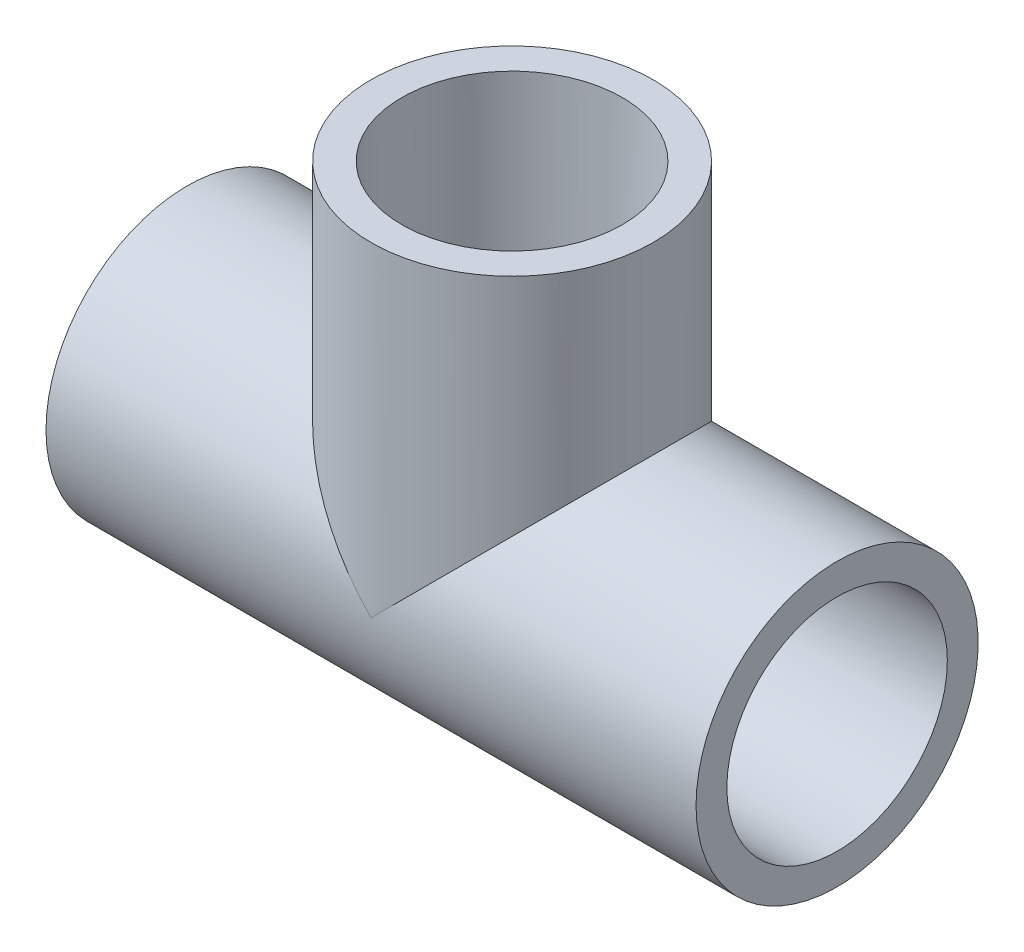
ISO-10303-21;
HEADER;
FILE_DESCRIPTION(('STEP AP214'),'2;1');
FILE_NAME('part.step','',(''),(''),'','','');
FILE_SCHEMA(('AUTOMOTIVE_DESIGN { 1 0 10303 214 1 1 1 1 }'));
ENDSEC;
DATA;
#1=APPLICATION_CONTEXT('core data for automotive mechanical design processes');
#2=APPLICATION_PROTOCOL_DEFINITION('international standard','automotive_design',2000,#1);
#3=PRODUCT_CONTEXT('',#1,'mechanical');
#4=PRODUCT('Part','Part','',(#3));
#5=PRODUCT_RELATED_PRODUCT_CATEGORY('part','',(#4));
#6=PRODUCT_DEFINITION_FORMATION('','',#4);
#7=PRODUCT_DEFINITION_CONTEXT('part definition',#1,'design');
#8=PRODUCT_DEFINITION('design','',#6,#7);
#9=PRODUCT_DEFINITION_SHAPE('','',#8);
#10=(LENGTH_UNIT() NAMED_UNIT(*) SI_UNIT(.MILLI.,.METRE.));
#11=(NAMED_UNIT(*) PLANE_ANGLE_UNIT() SI_UNIT($,.RADIAN.));
#12=(NAMED_UNIT(*) SI_UNIT($,.STERADIAN.) SOLID_ANGLE_UNIT());
#13=UNCERTAINTY_MEASURE_WITH_UNIT(LENGTH_MEASURE(1.E-05),#10,'distance_accuracy_value','');
#14=(GEOMETRIC_REPRESENTATION_CONTEXT(3) GLOBAL_UNCERTAINTY_ASSIGNED_CONTEXT((#13)) GLOBAL_UNIT_ASSIGNED_CONTEXT((#10,
#11,#12)) REPRESENTATION_CONTEXT('',''));
#15=CARTESIAN_POINT('',(0.,0.,0.));
#16=DIRECTION('',(0.,0.,1.));
#17=DIRECTION('',(1.,0.,0.));
#18=AXIS2_PLACEMENT_3D('',#15,#16,#17);
#19=CARTESIAN_POINT('',(-12.7,0.,0.));
#20=DIRECTION('',(1.,0.,0.));
#21=DIRECTION('',(0.,0.,-1.));
#22=AXIS2_PLACEMENT_3D('',#19,#20,#21);
#23=PLANE('',#22);
#24=CARTESIAN_POINT('',(-12.7,0.,0.));
#25=DIRECTION('',(-1.,0.,0.));
#26=DIRECTION('',(0.,0.,1.));
#27=AXIS2_PLACEMENT_3D('',#24,#25,#26);
#28=CIRCLE('',#27,10.6172);
#29=CARTESIAN_POINT('',(-12.7,0.,10.6172));
#30=VERTEX_POINT('',#29);
#31=EDGE_CURVE('E124',#30,#30,#28,.T.);
#32=ORIENTED_EDGE('',*,*,#31,.T.);
#33=EDGE_LOOP('',(#32));
#34=FACE_BOUND('',#33,.T.);
#35=CARTESIAN_POINT('',(-12.7,0.,0.));
#36=DIRECTION('',(1.,0.,0.));
#37=DIRECTION('',(0.,0.,-1.));
#38=AXIS2_PLACEMENT_3D('',#35,#36,#37);
#39=CIRCLE('',#38,7.8994);
#40=CARTESIAN_POINT('',(-12.7,0.,-7.8994));
#41=VERTEX_POINT('',#40);
#42=EDGE_CURVE('E127',#41,#41,#39,.T.);
#43=ORIENTED_EDGE('',*,*,#42,.T.);
#44=EDGE_LOOP('',(#43));
#45=FACE_BOUND('',#44,.T.);
#46=ADVANCED_FACE('F34',(#34,#45),#23,.F.);
#47=CARTESIAN_POINT('',(12.7,0.,0.));
#48=DIRECTION('',(1.,0.,0.));
#49=DIRECTION('',(0.,0.,-1.));
#50=AXIS2_PLACEMENT_3D('',#47,#48,#49);
#51=PLANE('',#50);
#52=CARTESIAN_POINT('',(12.7,0.,0.));
#53=DIRECTION('',(1.,0.,0.));
#54=DIRECTION('',(0.,0.,-1.));
#55=AXIS2_PLACEMENT_3D('',#52,#53,#54);
#56=CIRCLE('',#55,7.8994);
#57=CARTESIAN_POINT('',(12.7,0.,-7.8994));
#58=VERTEX_POINT('',#57);
#59=EDGE_CURVE('E130',#58,#58,#56,.T.);
#60=ORIENTED_EDGE('',*,*,#59,.F.);
#61=EDGE_LOOP('',(#60));
#62=FACE_BOUND('',#61,.T.);
#63=CARTESIAN_POINT('',(12.7,0.,0.));
#64=DIRECTION('',(1.,0.,0.));
#65=DIRECTION('',(0.,0.,-1.));
#66=AXIS2_PLACEMENT_3D('',#63,#64,#65);
#67=CIRCLE('',#66,10.6172);
#68=CARTESIAN_POINT('',(12.7,0.,-10.6172));
#69=VERTEX_POINT('',#68);
#70=EDGE_CURVE('E68',#69,#69,#67,.F.);
#71=ORIENTED_EDGE('',*,*,#70,.F.);
#72=EDGE_LOOP('',(#71));
#73=FACE_BOUND('',#72,.T.);
#74=ADVANCED_FACE('F114',(#62,#73),#51,.T.);
#75=CARTESIAN_POINT('',(12.7,0.,0.));
#76=DIRECTION('',(-1.,0.,0.));
#77=DIRECTION('',(0.,0.,1.));
#78=AXIS2_PLACEMENT_3D('',#75,#76,#77);
#79=CYLINDRICAL_SURFACE('',#78,13.7795);
#80=CARTESIAN_POINT('',(-4.76249999999999,-13.7795,0.));
#81=CARTESIAN_POINT('',(-4.76250323778712,-13.7795022283278,0.259306801760475));
#82=CARTESIAN_POINT('',(-4.74125381673582,-13.7721139773192,0.518590623755013));
#83=CARTESIAN_POINT('',(-4.65710116181763,-13.743371341111,1.02948841104388));
#84=CARTESIAN_POINT('',(-4.59419665317799,-13.7220165284923,1.28110214136349));
#85=CARTESIAN_POINT('',(-4.42917054734913,-13.6676532665384,1.76922070425727));
#86=CARTESIAN_POINT('',(-4.32711743215024,-13.6346651751866,2.0057510839472));
#87=CARTESIAN_POINT('',(-4.0870116372462,-13.5603789324736,2.45833415497864));
#88=CARTESIAN_POINT('',(-3.94895105194003,-13.5190789566562,2.6743823351408));
#89=CARTESIAN_POINT('',(-3.63540671680217,-13.4307877792447,3.08784070494789));
#90=CARTESIAN_POINT('',(-3.45883082570082,-13.3836529565944,3.28439179404207));
#91=CARTESIAN_POINT('',(-3.07558878284972,-13.2897700641533,3.64575866541256));
#92=CARTESIAN_POINT('',(-2.86891534197111,-13.2430220909577,3.81056673753441));
#93=CARTESIAN_POINT('',(-2.42342494261042,-13.1536004659263,4.1088288008419));
#94=CARTESIAN_POINT('',(-2.18380383656925,-13.1111003326523,4.2411387951005));
#95=CARTESIAN_POINT('',(-1.68400567326334,-13.0371846282897,4.46320923544905));
#96=CARTESIAN_POINT('',(-1.4238354636935,-13.0057653835686,4.55298378665544));
#97=CARTESIAN_POINT('',(-0.900133192789677,-12.9590876159537,4.6841636365105));
#98=CARTESIAN_POINT('',(-0.637056182734925,-12.94329001571,4.72718788261115));
#99=CARTESIAN_POINT('',(-0.10697926316918,-12.9280540676196,4.76870787765535));
#100=CARTESIAN_POINT('',(0.160019293923685,-12.9286102064113,4.767218633499));
#101=CARTESIAN_POINT('',(0.67628112492892,-12.9455486223949,4.72100539609268));
#102=CARTESIAN_POINT('',(0.925767103135719,-12.9611443615796,4.67843003835078));
#103=CARTESIAN_POINT('',(1.41380829715918,-13.0051119923387,4.55477157057887));
#104=CARTESIAN_POINT('',(1.65236210720845,-13.0334855219584,4.4736835233528));
#105=CARTESIAN_POINT('',(2.11650458109613,-13.1003468464723,4.27396116988505));
#106=CARTESIAN_POINT('',(2.34180462148937,-13.1389980685564,4.15471321077987));
#107=CARTESIAN_POINT('',(2.76985984694674,-13.2219952661049,3.882482281881));
#108=CARTESIAN_POINT('',(2.97260810805271,-13.2663429815788,3.72948899420163));
#109=CARTESIAN_POINT('',(3.36182942421718,-13.3587925504091,3.38392986065339));
#110=CARTESIAN_POINT('',(3.54673956409644,-13.4069650669372,3.18961875414215));
#111=CARTESIAN_POINT('',(3.88177380167382,-13.4994591996353,2.77216069291792));
#112=CARTESIAN_POINT('',(4.03189404269591,-13.5437803885215,2.54901054548546));
#113=CARTESIAN_POINT('',(4.2944730981667,-13.6242383599914,2.07670493948182));
#114=CARTESIAN_POINT('',(4.40648449747091,-13.6602764014544,1.82728275180465));
#115=CARTESIAN_POINT('',(4.58646357039052,-13.7193870555126,1.3115880800465));
#116=CARTESIAN_POINT('',(4.65444774436442,-13.7424645249912,1.04532194979041));
#117=CARTESIAN_POINT('',(4.7416072336974,-13.7722351934511,0.516707141680894));
#118=CARTESIAN_POINT('',(4.76289227796112,-13.779636043944,0.254745742294043));
#119=CARTESIAN_POINT('',(4.7620969429827,-13.7793602306627,-0.269075825186705));
#120=CARTESIAN_POINT('',(4.74002451237671,-13.7716863305114,-0.53093600303474));
#121=CARTESIAN_POINT('',(4.65479316349321,-13.7425908838451,-1.0384879126652));
#122=CARTESIAN_POINT('',(4.59295377904073,-13.721611144435,-1.28442909167628));
#123=CARTESIAN_POINT('',(4.43161839368014,-13.6684556483652,-1.76232690547167));
#124=CARTESIAN_POINT('',(4.33211753446566,-13.6362784472835,-1.99428173154803));
#125=CARTESIAN_POINT('',(4.09528543472195,-13.5628753862393,-2.44469922199783));
#126=CARTESIAN_POINT('',(3.95699457815471,-13.5214262533581,-2.66261986614872));
#127=CARTESIAN_POINT('',(3.64762214378014,-13.434149264708,-3.07283386829033));
#128=CARTESIAN_POINT('',(3.47652990429903,-13.3883199876642,-3.26511885918917));
#129=CARTESIAN_POINT('',(3.09650449736539,-13.2945877470081,-3.62842885844125));
#130=CARTESIAN_POINT('',(2.88612737119331,-13.2466932714962,-3.79794941253398));
#131=CARTESIAN_POINT('',(2.43890185313889,-13.1565033578083,-4.09949883101066));
#132=CARTESIAN_POINT('',(2.20205273719776,-13.1142080728499,-4.23152666954831));
#133=CARTESIAN_POINT('',(1.70805579842628,-13.0403671408035,-4.45390229530935));
#134=CARTESIAN_POINT('',(1.45091963047038,-13.0088153761787,-4.54427381273055));
#135=CARTESIAN_POINT('',(0.923719860294738,-12.9606237500226,-4.67997208422818));
#136=CARTESIAN_POINT('',(0.653662740824557,-12.9439764915033,-4.72532118379114));
#137=CARTESIAN_POINT('',(0.124305528830431,-12.9283614760022,-4.76786655478474));
#138=CARTESIAN_POINT('',(-0.134767192742619,-12.9284699638145,-4.76757879137468));
#139=CARTESIAN_POINT('',(-0.648963272247216,-12.944046138061,-4.72512322437281));
#140=CARTESIAN_POINT('',(-0.904086899135843,-12.9595127737973,-4.68295828572693));
#141=CARTESIAN_POINT('',(-1.39752733674375,-13.0033503141506,-4.55978086000162));
#142=CARTESIAN_POINT('',(-1.6360902876076,-13.031430155011,-4.47964247998512));
#143=CARTESIAN_POINT('',(-2.09655818319792,-13.0972039578165,-4.28351679107612));
#144=CARTESIAN_POINT('',(-2.31845924926209,-13.1349001493932,-4.16752116705861));
#145=CARTESIAN_POINT('',(-2.75044528065329,-13.2178331389839,-3.89671871488194));
#146=CARTESIAN_POINT('',(-2.95950807545154,-13.2633381827682,-3.74036410889009));
#147=CARTESIAN_POINT('',(-3.34923945009435,-13.3556992021336,-3.39583443640914));
#148=CARTESIAN_POINT('',(-3.52989969007521,-13.4025555697431,-3.20765005726555));
#149=CARTESIAN_POINT('',(-3.86557108060606,-13.4947638802842,-2.79507932280257));
#150=CARTESIAN_POINT('',(-4.01914183991157,-13.5399640331985,-2.56948256554598));
#151=CARTESIAN_POINT('',(-4.28604457740129,-13.6215708544717,-2.09415373959609));
#152=CARTESIAN_POINT('',(-4.39938323654584,-13.6579789825167,-1.8444256869272));
#153=CARTESIAN_POINT('',(-4.58003970162028,-13.7172450458337,-1.33293474000778));
#154=CARTESIAN_POINT('',(-4.64822874333038,-13.7403583005949,-1.07151039487821));
#155=CARTESIAN_POINT('',(-4.73944974181329,-13.7714821208898,-0.540047142312848));
#156=CARTESIAN_POINT('',(-4.76249662855543,-13.7794976796858,-0.270011113077838));
#157=CARTESIAN_POINT('',(-4.76249999999999,-13.7795,0.));
#158=B_SPLINE_CURVE_WITH_KNOTS('',3,(#80,#81,#82,#83,#84,#85,#86,#87,#88,#89,#90,#91,#92,#93,
#94,#95,#96,#97,#98,#99,#100,#101,#102,#103,#104,#105,#106,#107,#108,#109,#110,#111,#112,#113,
#114,#115,#116,#117,#118,#119,#120,#121,#122,#123,#124,#125,#126,#127,#128,#129,#130,#131,#132,
#133,#134,#135,#136,#137,#138,#139,#140,#141,#142,#143,#144,#145,#146,#147,#148,#149,#150,#151,
#152,#153,#154,#155,#156,#157),.UNSPECIFIED.,.T.,.F.,(4,2,2,2,2,2,2,2,2,2,2,2,2,2,2,2,2,2,2,2,2,
2,2,2,2,2,2,2,2,2,2,2,2,2,2,2,2,2,4),(0.,0.776926093261884,1.55387596393115,2.32947288175535,
3.10524022891048,3.90681435747787,4.70858293788283,5.53546906381101,6.36208079498898,
7.15905277835106,7.95575608037797,8.71293319890505,9.47020741117954,10.2403291859168,
11.0106867583494,11.8244936677936,12.6383907496715,13.4615378316683,14.2843762388838,
15.0692020699988,15.8538840340462,16.613785560855,17.373785147906,18.1545562694153,
18.9355816022628,19.7548974056055,20.5742356242656,21.3931065150426,22.2115707810618,
22.9849296122468,23.7582355392277,24.5145467249716,25.2710334274312,26.0625313903954,
26.8542613291782,27.6801017520139,28.5058049711977,29.3150706482591,30.1240686297877),.UNSPECIFIED.);
#159=CARTESIAN_POINT('',(-4.76249999999999,-13.7795,0.));
#160=VERTEX_POINT('',#159);
#161=EDGE_CURVE('E11',#160,#160,#158,.T.);
#162=ORIENTED_EDGE('',*,*,#161,.T.);
#163=EDGE_LOOP('',(#162));
#164=FACE_BOUND('',#163,.T.);
#165=CARTESIAN_POINT('',(-31.75,0.,0.));
#166=DIRECTION('',(-1.,0.,0.));
#167=DIRECTION('',(0.,0.,1.));
#168=AXIS2_PLACEMENT_3D('',#165,#166,#167);
#169=CIRCLE('',#168,13.7795);
#170=CARTESIAN_POINT('',(-31.75,0.,13.7795));
#171=VERTEX_POINT('',#170);
#172=EDGE_CURVE('E143',#171,#171,#169,.T.);
#173=ORIENTED_EDGE('',*,*,#172,.F.);
#174=EDGE_LOOP('',(#173));
#175=FACE_BOUND('',#174,.T.);
#176=CARTESIAN_POINT('',(31.75,0.,0.));
#177=DIRECTION('',(-1.,0.,0.));
#178=DIRECTION('',(0.,0.,1.));
#179=AXIS2_PLACEMENT_3D('',#176,#177,#178);
#180=CIRCLE('',#179,13.7795);
#181=CARTESIAN_POINT('',(31.75,0.,13.7795));
#182=VERTEX_POINT('',#181);
#183=EDGE_CURVE('E129',#182,#182,#180,.T.);
#184=ORIENTED_EDGE('',*,*,#183,.T.);
#185=EDGE_LOOP('',(#184));
#186=FACE_BOUND('',#185,.T.);
#187=CARTESIAN_POINT('',(0.,0.,0.));
#188=DIRECTION('',(-0.707106781186548,-0.707106781186547,0.));
#189=DIRECTION('',(0.707106781186547,-0.707106781186548,0.));
#190=AXIS2_PLACEMENT_3D('',#187,#188,#189);
#191=ELLIPSE('',#190,19.4871557827201,13.7795);
#192=CARTESIAN_POINT('',(0.,0.,13.7795));
#193=VERTEX_POINT('',#192);
#194=CARTESIAN_POINT('',(0.,0.,-13.7795));
#195=VERTEX_POINT('',#194);
#196=EDGE_CURVE('E150',#193,#195,#191,.T.);
#197=ORIENTED_EDGE('',*,*,#196,.T.);
#198=CARTESIAN_POINT('',(0.,0.,0.));
#199=DIRECTION('',(0.707106781186547,-0.707106781186548,0.));
#200=DIRECTION('',(-0.707106781186548,-0.707106781186547,0.));
#201=AXIS2_PLACEMENT_3D('',#198,#199,#200);
#202=ELLIPSE('',#201,19.4871557827201,13.7795);
#203=EDGE_CURVE('E59',#195,#193,#202,.T.);
#204=ORIENTED_EDGE('',*,*,#203,.T.);
#205=EDGE_LOOP('',(#197,#204));
#206=FACE_BOUND('',#205,.T.);
#207=ADVANCED_FACE('F77',(#164,#175,#186,#206),#79,.T.);
#208=CARTESIAN_POINT('',(-12.7,0.,0.));
#209=DIRECTION('',(-1.,0.,0.));
#210=DIRECTION('',(0.,0.,1.));
#211=AXIS2_PLACEMENT_3D('',#208,#209,#210);
#212=CONICAL_SURFACE('',#211,10.6172,0.00799982933988648);
#213=CARTESIAN_POINT('',(-31.75,0.,0.));
#214=DIRECTION('',(-1.,0.,0.));
#215=DIRECTION('',(0.,0.,1.));
#216=AXIS2_PLACEMENT_3D('',#213,#214,#215);
#217=CIRCLE('',#216,10.7696);
#218=CARTESIAN_POINT('',(-31.75,0.,10.7696));
#219=VERTEX_POINT('',#218);
#220=EDGE_CURVE('E147',#219,#219,#217,.T.);
#221=ORIENTED_EDGE('',*,*,#220,.T.);
#222=EDGE_LOOP('',(#221));
#223=FACE_BOUND('',#222,.T.);
#224=ORIENTED_EDGE('',*,*,#31,.F.);
#225=EDGE_LOOP('',(#224));
#226=FACE_BOUND('',#225,.T.);
#227=ADVANCED_FACE('F101',(#223,#226),#212,.F.);
#228=CARTESIAN_POINT('',(31.75,0.,0.));
#229=DIRECTION('',(1.,0.,0.));
#230=DIRECTION('',(0.,0.,-1.));
#231=AXIS2_PLACEMENT_3D('',#228,#229,#230);
#232=CONICAL_SURFACE('',#231,10.7696,0.00799982933988629);
#233=CARTESIAN_POINT('',(31.75,0.,0.));
#234=DIRECTION('',(-1.,0.,0.));
#235=DIRECTION('',(0.,0.,1.));
#236=AXIS2_PLACEMENT_3D('',#233,#234,#235);
#237=CIRCLE('',#236,10.7696);
#238=CARTESIAN_POINT('',(31.75,0.,10.7696));
#239=VERTEX_POINT('',#238);
#240=EDGE_CURVE('E133',#239,#239,#237,.T.);
#241=ORIENTED_EDGE('',*,*,#240,.F.);
#242=EDGE_LOOP('',(#241));
#243=FACE_BOUND('',#242,.T.);
#244=ORIENTED_EDGE('',*,*,#70,.T.);
#245=EDGE_LOOP('',(#244));
#246=FACE_BOUND('',#245,.T.);
#247=ADVANCED_FACE('F97',(#243,#246),#232,.F.);
#248=CARTESIAN_POINT('',(0.,31.75,0.));
#249=DIRECTION('',(0.,1.,0.));
#250=DIRECTION('',(-1.,0.,0.));
#251=AXIS2_PLACEMENT_3D('',#248,#249,#250);
#252=CONICAL_SURFACE('',#251,10.7696,0.00799982933988657);
#253=CARTESIAN_POINT('',(0.,31.75,0.));
#254=DIRECTION('',(0.,-1.,0.));
#255=DIRECTION('',(1.,0.,0.));
#256=AXIS2_PLACEMENT_3D('',#253,#254,#255);
#257=CIRCLE('',#256,10.7696);
#258=CARTESIAN_POINT('',(10.7696,31.75,0.));
#259=VERTEX_POINT('',#258);
#260=EDGE_CURVE('E152',#259,#259,#257,.T.);
#261=ORIENTED_EDGE('',*,*,#260,.F.);
#262=EDGE_LOOP('',(#261));
#263=FACE_BOUND('',#262,.T.);
#264=CARTESIAN_POINT('',(0.,12.7,0.));
#265=DIRECTION('',(0.,-1.,0.));
#266=DIRECTION('',(1.,0.,0.));
#267=AXIS2_PLACEMENT_3D('',#264,#265,#266);
#268=CIRCLE('',#267,10.6172);
#269=CARTESIAN_POINT('',(10.6172,12.7,0.));
#270=VERTEX_POINT('',#269);
#271=EDGE_CURVE('E155',#270,#270,#268,.T.);
#272=ORIENTED_EDGE('',*,*,#271,.T.);
#273=EDGE_LOOP('',(#272));
#274=FACE_BOUND('',#273,.T.);
#275=ADVANCED_FACE('F100',(#263,#274),#252,.F.);
#276=CARTESIAN_POINT('',(13.7795,31.75,0.));
#277=DIRECTION('',(0.,1.,0.));
#278=DIRECTION('',(-1.,0.,0.));
#279=AXIS2_PLACEMENT_3D('',#276,#277,#278);
#280=PLANE('',#279);
#281=ORIENTED_EDGE('',*,*,#260,.T.);
#282=EDGE_LOOP('',(#281));
#283=FACE_BOUND('',#282,.T.);
#284=CARTESIAN_POINT('',(0.,31.75,0.));
#285=DIRECTION('',(0.,-1.,0.));
#286=DIRECTION('',(1.,0.,0.));
#287=AXIS2_PLACEMENT_3D('',#284,#285,#286);
#288=CIRCLE('',#287,13.7795);
#289=CARTESIAN_POINT('',(13.7795,31.75,0.));
#290=VERTEX_POINT('',#289);
#291=EDGE_CURVE('E158',#290,#290,#288,.T.);
#292=ORIENTED_EDGE('',*,*,#291,.F.);
#293=EDGE_LOOP('',(#292));
#294=FACE_BOUND('',#293,.T.);
#295=ADVANCED_FACE('F36',(#283,#294),#280,.T.);
#296=CARTESIAN_POINT('',(0.,0.,0.));
#297=DIRECTION('',(0.,-1.,0.));
#298=DIRECTION('',(1.,0.,0.));
#299=AXIS2_PLACEMENT_3D('',#296,#297,#298);
#300=CYLINDRICAL_SURFACE('',#299,13.7795);
#301=ORIENTED_EDGE('',*,*,#203,.F.);
#302=ORIENTED_EDGE('',*,*,#196,.F.);
#303=EDGE_LOOP('',(#301,#302));
#304=FACE_BOUND('',#303,.T.);
#305=ORIENTED_EDGE('',*,*,#291,.T.);
#306=EDGE_LOOP('',(#305));
#307=FACE_BOUND('',#306,.T.);
#308=ADVANCED_FACE('F112',(#304,#307),#300,.T.);
#309=CARTESIAN_POINT('',(-31.75,-13.7795,0.));
#310=DIRECTION('',(-1.,0.,0.));
#311=DIRECTION('',(0.,0.,1.));
#312=AXIS2_PLACEMENT_3D('',#309,#310,#311);
#313=PLANE('',#312);
#314=ORIENTED_EDGE('',*,*,#172,.T.);
#315=EDGE_LOOP('',(#314));
#316=FACE_BOUND('',#315,.T.);
#317=ORIENTED_EDGE('',*,*,#220,.F.);
#318=EDGE_LOOP('',(#317));
#319=FACE_BOUND('',#318,.T.);
#320=ADVANCED_FACE('F105',(#316,#319),#313,.T.);
#321=CARTESIAN_POINT('',(31.75,-13.7795,0.));
#322=DIRECTION('',(1.,0.,0.));
#323=DIRECTION('',(0.,0.,-1.));
#324=AXIS2_PLACEMENT_3D('',#321,#322,#323);
#325=PLANE('',#324);
#326=ORIENTED_EDGE('',*,*,#240,.T.);
#327=EDGE_LOOP('',(#326));
#328=FACE_BOUND('',#327,.T.);
#329=ORIENTED_EDGE('',*,*,#183,.F.);
#330=EDGE_LOOP('',(#329));
#331=FACE_BOUND('',#330,.T.);
#332=ADVANCED_FACE('F95',(#328,#331),#325,.T.);
#333=CARTESIAN_POINT('',(0.,12.7,0.));
#334=DIRECTION('',(0.,-1.,0.));
#335=DIRECTION('',(1.,0.,0.));
#336=AXIS2_PLACEMENT_3D('',#333,#334,#335);
#337=PLANE('',#336);
#338=CARTESIAN_POINT('',(0.,12.7,0.));
#339=DIRECTION('',(0.,-1.,0.));
#340=DIRECTION('',(1.,0.,0.));
#341=AXIS2_PLACEMENT_3D('',#338,#339,#340);
#342=CIRCLE('',#341,7.8994);
#343=CARTESIAN_POINT('',(7.8994,12.7,0.));
#344=VERTEX_POINT('',#343);
#345=EDGE_CURVE('E136',#344,#344,#342,.T.);
#346=ORIENTED_EDGE('',*,*,#345,.T.);
#347=EDGE_LOOP('',(#346));
#348=FACE_BOUND('',#347,.T.);
#349=ORIENTED_EDGE('',*,*,#271,.F.);
#350=EDGE_LOOP('',(#349));
#351=FACE_BOUND('',#350,.T.);
#352=ADVANCED_FACE('F91',(#348,#351),#337,.F.);
#353=CARTESIAN_POINT('',(31.75,0.,0.));
#354=DIRECTION('',(1.,0.,0.));
#355=DIRECTION('',(0.,0.,-1.));
#356=AXIS2_PLACEMENT_3D('',#353,#354,#355);
#357=CYLINDRICAL_SURFACE('',#356,7.8994);
#358=CARTESIAN_POINT('',(0.,-6.3023102200701,4.7625));
#359=CARTESIAN_POINT('',(0.119474198317857,-6.30231208968022,4.76249876575264));
#360=CARTESIAN_POINT('',(0.238994007226276,-6.30572266206058,4.75799465071337));
#361=CARTESIAN_POINT('',(0.477035861705315,-6.31921912790842,4.74005389887775));
#362=CARTESIAN_POINT('',(0.595557125952792,-6.32930983139483,4.72661082556616));
#363=CARTESIAN_POINT('',(0.830861280695969,-6.35576509376661,4.69097674131843));
#364=CARTESIAN_POINT('',(0.947639338714556,-6.37214459157606,4.66876489674182));
#365=CARTESIAN_POINT('',(1.17835924691207,-6.41051265980581,4.61594053941176));
#366=CARTESIAN_POINT('',(1.29229966927954,-6.43250399375057,4.58532388718267));
#367=CARTESIAN_POINT('',(1.62686629667951,-6.50529048654004,4.48205233013787));
#368=CARTESIAN_POINT('',(1.84243733048216,-6.56317097089869,4.39763175773054));
#369=CARTESIAN_POINT('',(2.25598230998079,-6.6910170476909,4.20054138666679));
#370=CARTESIAN_POINT('',(2.45395818780929,-6.76098131070936,4.08787469493462));
#371=CARTESIAN_POINT('',(2.85383506244949,-6.91559226986492,3.82121745089026));
#372=CARTESIAN_POINT('',(3.05318873614523,-7.00098440740999,3.66383808552844));
#373=CARTESIAN_POINT('',(3.42487516413167,-7.17088097316263,3.31902043057731));
#374=CARTESIAN_POINT('',(3.59718531647153,-7.25538460434255,3.13155725991604));
#375=CARTESIAN_POINT('',(3.84120241905096,-7.38027056796471,2.81897633372772));
#376=CARTESIAN_POINT('',(3.92357528271516,-7.42356436726686,2.70319919688675));
#377=CARTESIAN_POINT('',(4.0781550351532,-7.50641033224216,2.46380544165734));
#378=CARTESIAN_POINT('',(4.15036615176872,-7.54596405173224,2.34019211478671));
#379=CARTESIAN_POINT('',(4.28383205707604,-7.62018759770658,2.08585867423063));
#380=CARTESIAN_POINT('',(4.34509184632811,-7.65485965169723,1.95514183986452));
#381=CARTESIAN_POINT('',(4.45588337867244,-7.7182864593598,1.68744791094804));
#382=CARTESIAN_POINT('',(4.50541707225829,-7.74704219703479,1.55047186207055));
#383=CARTESIAN_POINT('',(4.58782222584381,-7.79526926233204,1.28480950581427));
#384=CARTESIAN_POINT('',(4.62183736832193,-7.81536720170977,1.1565912939834));
#385=CARTESIAN_POINT('',(4.67915419025268,-7.84939900827465,0.896986323111509));
#386=CARTESIAN_POINT('',(4.7024574964019,-7.86333381138185,0.765600048363153));
#387=CARTESIAN_POINT('',(4.73796553285759,-7.88461981543802,0.500906187969398));
#388=CARTESIAN_POINT('',(4.75017856852429,-7.89197594300943,0.367600116165859));
#389=CARTESIAN_POINT('',(4.76332518098913,-7.89989570136121,0.100236830915776));
#390=CARTESIAN_POINT('',(4.76425992196965,-7.90046003321289,-0.0338203035744064));
#391=CARTESIAN_POINT('',(4.75543164687325,-7.89514007620584,-0.284578501471622));
#392=CARTESIAN_POINT('',(4.7469965467509,-7.89005624298152,-0.401346209649925));
#393=CARTESIAN_POINT('',(4.72160442507234,-7.87480534231315,-0.633651682864964));
#394=CARTESIAN_POINT('',(4.70464482679137,-7.86463673788537,-0.749189065217659));
#395=CARTESIAN_POINT('',(4.6624197382965,-7.83945046923276,-0.978157581898232));
#396=CARTESIAN_POINT('',(4.63715706612447,-7.82443445023869,-1.09158941706295));
#397=CARTESIAN_POINT('',(4.57862675693328,-7.78988999621352,-1.31568155714016));
#398=CARTESIAN_POINT('',(4.54535601785214,-7.77035981266008,-1.42634076964436));
#399=CARTESIAN_POINT('',(4.43366554386626,-7.70537284420164,-1.75425530725642));
#400=CARTESIAN_POINT('',(4.34355907765905,-7.65363715731242,-1.96642571676053));
#401=CARTESIAN_POINT('',(4.13565374965768,-7.53759408395519,-2.37276486513598));
#402=CARTESIAN_POINT('',(4.01784781118478,-7.47328348554901,-2.5669289860437));
#403=CARTESIAN_POINT('',(3.74190044057506,-7.32840449432134,-2.95689701441113));
#404=CARTESIAN_POINT('',(3.58061450253126,-7.24681119443957,-3.15009930015193));
#405=CARTESIAN_POINT('',(3.23047881782626,-7.08034653084365,-3.50832643295946));
#406=CARTESIAN_POINT('',(3.04159140485033,-6.99547080605902,-3.67331209560425));
#407=CARTESIAN_POINT('',(2.61506489434626,-6.82023635302111,-3.99015337432987));
#408=CARTESIAN_POINT('',(2.37430498400204,-6.73040624098003,-4.13818459622969));
#409=CARTESIAN_POINT('',(1.99324656727778,-6.60891062043657,-4.32764326681384));
#410=CARTESIAN_POINT('',(1.86294119116631,-6.57062798127045,-4.38535479552377));
#411=CARTESIAN_POINT('',(1.59629375816453,-6.50005535566083,-4.48928990529442));
#412=CARTESIAN_POINT('',(1.45995412330502,-6.4677629913796,-4.53551804716366));
#413=CARTESIAN_POINT('',(1.1125891316403,-6.39652632477736,-4.63578533380827));
#414=CARTESIAN_POINT('',(0.898277822432987,-6.36231749485467,-4.68219039972877));
#415=CARTESIAN_POINT('',(0.463173359816834,-6.31561630653865,-4.74500832628484));
#416=CARTESIAN_POINT('',(0.242388206598507,-6.30309820563621,-4.76145674059443));
#417=CARTESIAN_POINT('',(-0.199747871501233,-6.30159435678184,-4.76344781854004));
#418=CARTESIAN_POINT('',(-0.42109915026829,-6.31264342329415,-4.74894475926996));
#419=CARTESIAN_POINT('',(-0.857553223458888,-6.35666626969671,-4.68984082143437));
#420=CARTESIAN_POINT('',(-1.07265090276136,-6.38965749822835,-4.64521598929249));
#421=CARTESIAN_POINT('',(-1.49081411038182,-6.47299423849518,-4.52834777696891));
#422=CARTESIAN_POINT('',(-1.69391222771046,-6.52328995028708,-4.45618358693545));
#423=CARTESIAN_POINT('',(-2.0857598894186,-6.63582771385613,-4.28679666704537));
#424=CARTESIAN_POINT('',(-2.2745040304953,-6.69807423353289,-4.18956456068347));
#425=CARTESIAN_POINT('',(-2.66859397975857,-6.84111785715365,-3.95247959401602));
#426=CARTESIAN_POINT('',(-2.87073167538788,-6.92323106643462,-3.80809359558625));
#427=CARTESIAN_POINT('',(-3.25010409595416,-7.08894531519502,-3.48991945171005));
#428=CARTESIAN_POINT('',(-3.42731440178419,-7.17254772444449,-3.31610283795356));
#429=CARTESIAN_POINT('',(-3.68293498457041,-7.29908927574464,-3.02278577802412));
#430=CARTESIAN_POINT('',(-3.77091854337705,-7.3439714470282,-2.91232369937238));
#431=CARTESIAN_POINT('',(-3.93720606462177,-7.43072453693279,-2.68324955440313));
#432=CARTESIAN_POINT('',(-4.01551360381719,-7.47259656585006,-2.56464052499775));
#433=CARTESIAN_POINT('',(-4.16171765682344,-7.55216857487647,-2.3198772519899));
#434=CARTESIAN_POINT('',(-4.22961651063085,-7.58986949216929,-2.1937247131492));
#435=CARTESIAN_POINT('',(-4.35423242537565,-7.66001309743088,-1.9346118097593));
#436=CARTESIAN_POINT('',(-4.41095100257194,-7.6924564983129,-1.80165237144085));
#437=CARTESIAN_POINT('',(-4.50879034721552,-7.74898881077598,-1.53959680958169));
#438=CARTESIAN_POINT('',(-4.55073506178731,-7.77350854614436,-1.41090148396243));
#439=CARTESIAN_POINT('',(-4.62369451510174,-7.81644381113469,-1.14946312699249));
#440=CARTESIAN_POINT('',(-4.65471101915371,-7.83486032662333,-1.01672075315705));
#441=CARTESIAN_POINT('',(-4.70530012413416,-7.86502072659522,-0.748446783153631));
#442=CARTESIAN_POINT('',(-4.72488304134783,-7.87677062595509,-0.612917815949317));
#443=CARTESIAN_POINT('',(-4.75230422487309,-7.89324950464484,-0.340259251985903));
#444=CARTESIAN_POINT('',(-4.76014406635094,-7.89797942560401,-0.203129872386606));
#445=CARTESIAN_POINT('',(-4.76368682088531,-7.90011571249182,0.0527535295994283));
#446=CARTESIAN_POINT('',(-4.76088883962547,-7.89842666842638,0.171482506805584));
#447=CARTESIAN_POINT('',(-4.74645266668903,-7.88973341935666,0.408243707159579));
#448=CARTESIAN_POINT('',(-4.73481180552273,-7.88272760932701,0.526275709059018));
#449=CARTESIAN_POINT('',(-4.70284420470136,-7.86356742825198,0.760687398337855));
#450=CARTESIAN_POINT('',(-4.68252089805168,-7.85141509213961,0.87706772001344));
#451=CARTESIAN_POINT('',(-4.63345335781863,-7.82225176607337,1.10743440438276));
#452=CARTESIAN_POINT('',(-4.60470587087803,-7.80523889908151,1.22141982392236));
#453=CARTESIAN_POINT('',(-4.50750926864413,-7.74815981936502,1.55450449906942));
#454=CARTESIAN_POINT('',(-4.42746905222322,-7.70165930253942,1.76925314688313));
#455=CARTESIAN_POINT('',(-4.23924639095229,-7.59502050143955,2.18216033298182));
#456=CARTESIAN_POINT('',(-4.13105799578111,-7.53487933397568,2.38031535177224));
#457=CARTESIAN_POINT('',(-3.87650538083255,-7.39821812905868,2.77770121516403));
#458=CARTESIAN_POINT('',(-3.72727767514295,-7.32063011051793,2.97473017469159));
#459=CARTESIAN_POINT('',(-3.40143779792467,-7.16022071842831,3.34247181249335));
#460=CARTESIAN_POINT('',(-3.2247938822578,-7.07739334514556,3.51315352153852));
#461=CARTESIAN_POINT('',(-2.82247594417082,-6.90278649228275,3.84600115133878));
#462=CARTESIAN_POINT('',(-2.59341620073214,-6.81123185411934,4.00422258254826));
#463=CARTESIAN_POINT('',(-2.1074455197098,-6.64144658001528,4.2799505373165));
#464=CARTESIAN_POINT('',(-1.85055736215626,-6.56320517889404,4.397490036885));
#465=CARTESIAN_POINT('',(-1.37390844930707,-6.44718003114974,4.56535312354304));
#466=CARTESIAN_POINT('',(-1.15867286195636,-6.40426296917702,4.62482640268221));
#467=CARTESIAN_POINT('',(-0.829328052057046,-6.35571045791193,4.69107366906308));
#468=CARTESIAN_POINT('',(-0.718585964581285,-6.34216950071804,4.70932172178571));
#469=CARTESIAN_POINT('',(-0.495569963363398,-6.32079346277837,4.73797685593654));
#470=CARTESIAN_POINT('',(-0.383297040909636,-6.31295485304777,4.74838878700642));
#471=CARTESIAN_POINT('',(-0.225663208023494,-6.30618777297585,4.75736506488672));
#472=CARTESIAN_POINT('',(-0.180569829262826,-6.30473509281745,4.75928970054675));
#473=CARTESIAN_POINT('',(-0.0903198113908458,-6.30279589703197,4.7618574888745));
#474=CARTESIAN_POINT('',(-0.045163164483947,-6.30230951332747,4.7625004665653));
#475=CARTESIAN_POINT('',(0.,-6.3023102200701,4.7625));
#476=B_SPLINE_CURVE_WITH_KNOTS('',3,(#358,#359,#360,#361,#362,#363,#364,#365,#366,#367,#368,
#369,#370,#371,#372,#373,#374,#375,#376,#377,#378,#379,#380,#381,#382,#383,#384,#385,#386,#387,
#388,#389,#390,#391,#392,#393,#394,#395,#396,#397,#398,#399,#400,#401,#402,#403,#404,#405,#406,
#407,#408,#409,#410,#411,#412,#413,#414,#415,#416,#417,#418,#419,#420,#421,#422,#423,#424,#425,
#426,#427,#428,#429,#430,#431,#432,#433,#434,#435,#436,#437,#438,#439,#440,#441,#442,#443,#444,
#445,#446,#447,#448,#449,#450,#451,#452,#453,#454,#455,#456,#457,#458,#459,#460,#461,#462,#463,
#464,#465,#466,#467,#468,#469,#470,#471,#472,#473,#474,#475),.UNSPECIFIED.,.T.,.F.,(4,2,2,2,2,2,
2,2,2,2,2,2,2,2,2,2,2,2,2,2,2,2,2,2,2,2,2,2,2,2,2,2,2,2,2,2,2,2,2,2,2,2,2,2,2,2,2,2,2,2,2,2,2,2,
2,2,2,2,4),(0.,0.358369486131111,0.716997296778403,1.07648234591409,1.4361447646853,
2.14882705112292,2.86143098063209,3.66223927371008,4.46371332835501,4.90882357956729,
5.35374808959134,5.79846891777483,6.24311571999017,6.64503844547217,7.04690011489629,
7.44846058651957,7.84997960740559,8.20110531077745,8.55233721381745,8.9034500325412,
9.25469908034629,9.96029927615306,10.666079935393,11.4565924546131,12.248193998381,
13.1328663687258,13.5749891667764,14.0169360870063,14.6796555550389,15.3415879689941,
16.0044988960172,16.6679376081796,17.3294827870258,17.9912757728305,18.7732308125314,
19.5559466062894,20.0000023544203,20.4438934623786,20.8876846315134,21.3314155726239,
21.7434988675817,22.1555155653267,22.5671599322539,22.9787490780095,23.3346298236604,
23.6906180453505,24.046465640757,24.4024508434389,25.1008407938859,25.7993784990333,
26.573471930297,27.3484684336346,28.2235226102638,29.0978658140664,29.7768946138878,
30.1156879214286,30.4542713827759,30.589722309221,30.7251917266856),.UNSPECIFIED.);
#477=CARTESIAN_POINT('',(0.,-6.3023102200701,4.7625));
#478=VERTEX_POINT('',#477);
#479=EDGE_CURVE('E38',#478,#478,#476,.T.);
#480=ORIENTED_EDGE('',*,*,#479,.F.);
#481=EDGE_LOOP('',(#480));
#482=FACE_BOUND('',#481,.T.);
#483=CARTESIAN_POINT('',(0.,0.,0.));
#484=DIRECTION('',(0.707106781186547,-0.707106781186547,0.));
#485=DIRECTION('',(0.707106781186547,0.707106781186547,0.));
#486=AXIS2_PLACEMENT_3D('',#483,#484,#485);
#487=ELLIPSE('',#486,11.17143861461,7.8994);
#488=CARTESIAN_POINT('',(0.,0.,-7.8994));
#489=VERTEX_POINT('',#488);
#490=CARTESIAN_POINT('',(0.,0.,7.8994));
#491=VERTEX_POINT('',#490);
#492=EDGE_CURVE('E47',#489,#491,#487,.T.);
#493=ORIENTED_EDGE('',*,*,#492,.F.);
#494=CARTESIAN_POINT('',(0.,0.,0.));
#495=DIRECTION('',(0.707106781186547,0.707106781186547,0.));
#496=DIRECTION('',(0.707106781186547,-0.707106781186547,0.));
#497=AXIS2_PLACEMENT_3D('',#494,#495,#496);
#498=ELLIPSE('',#497,11.17143861461,7.8994);
#499=EDGE_CURVE('E64',#491,#489,#498,.F.);
#500=ORIENTED_EDGE('',*,*,#499,.F.);
#501=EDGE_LOOP('',(#493,#500));
#502=FACE_BOUND('',#501,.T.);
#503=ORIENTED_EDGE('',*,*,#59,.T.);
#504=EDGE_LOOP('',(#503));
#505=FACE_BOUND('',#504,.T.);
#506=ORIENTED_EDGE('',*,*,#42,.F.);
#507=EDGE_LOOP('',(#506));
#508=FACE_BOUND('',#507,.T.);
#509=ADVANCED_FACE('F70',(#482,#502,#505,#508),#357,.F.);
#510=CARTESIAN_POINT('',(0.,0.,0.));
#511=DIRECTION('',(0.,-1.,0.));
#512=DIRECTION('',(1.,0.,0.));
#513=AXIS2_PLACEMENT_3D('',#510,#511,#512);
#514=CYLINDRICAL_SURFACE('',#513,7.8994);
#515=ORIENTED_EDGE('',*,*,#492,.T.);
#516=ORIENTED_EDGE('',*,*,#499,.T.);
#517=EDGE_LOOP('',(#515,#516));
#518=FACE_BOUND('',#517,.T.);
#519=ORIENTED_EDGE('',*,*,#345,.F.);
#520=EDGE_LOOP('',(#519));
#521=FACE_BOUND('',#520,.T.);
#522=ADVANCED_FACE('F65',(#518,#521),#514,.F.);
#523=CARTESIAN_POINT('',(0.,31.75,0.));
#524=DIRECTION('',(0.,1.,0.));
#525=DIRECTION('',(0.,0.,1.));
#526=AXIS2_PLACEMENT_3D('',#523,#524,#525);
#527=CYLINDRICAL_SURFACE('',#526,4.7625);
#528=ORIENTED_EDGE('',*,*,#479,.T.);
#529=EDGE_LOOP('',(#528));
#530=FACE_BOUND('',#529,.T.);
#531=ORIENTED_EDGE('',*,*,#161,.F.);
#532=EDGE_LOOP('',(#531));
#533=FACE_BOUND('',#532,.T.);
#534=ADVANCED_FACE('F81',(#530,#533),#527,.F.);
#535=CLOSED_SHELL('',(#46,#74,#207,#227,#247,#275,#295,#308,#320,#332,#352,#509,#522,#534));
#536=MANIFOLD_SOLID_BREP('B2',#535);
#537=ADVANCED_BREP_SHAPE_REPRESENTATION('',(#18,#536),#14);
#538=SHAPE_DEFINITION_REPRESENTATION(#9,#537);
ENDSEC;
END-ISO-10303-21;
